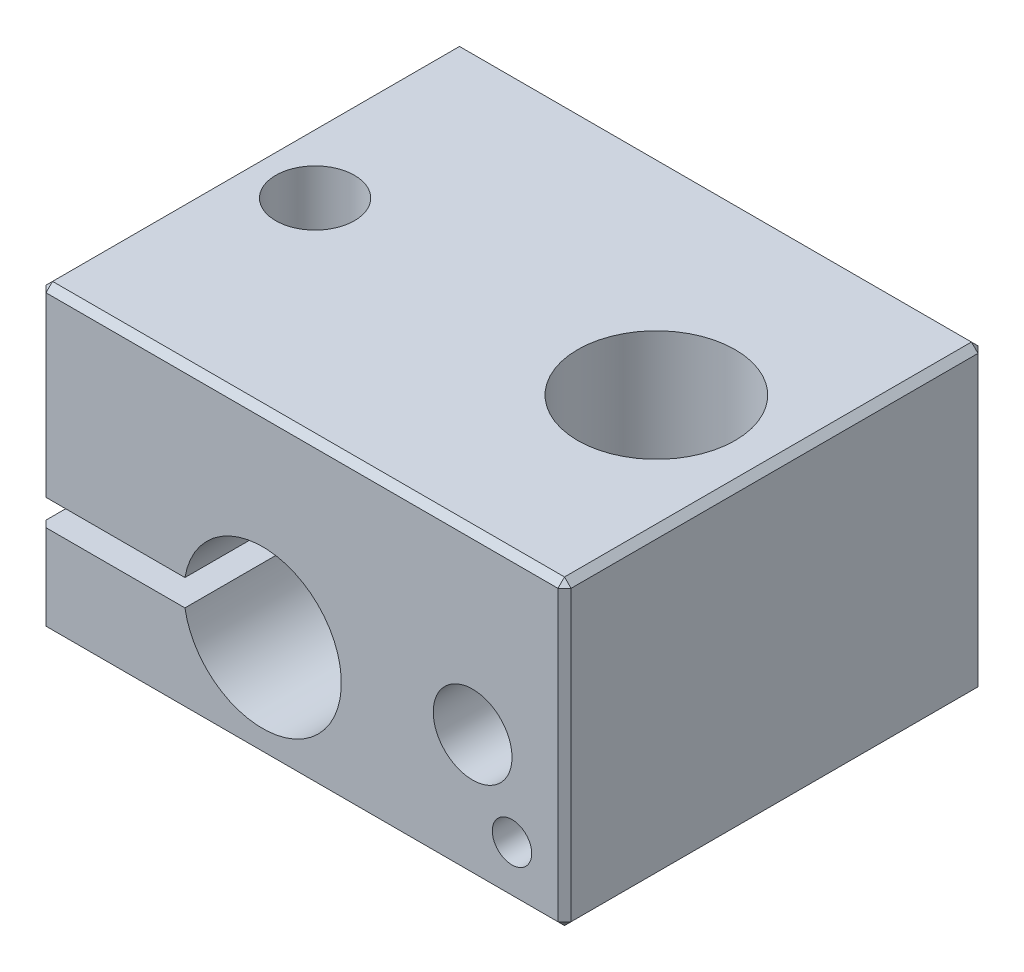
ISO-10303-21;
HEADER;
FILE_DESCRIPTION(('STEP AP214'),'2;1');
FILE_NAME('part.step','',(''),(''),'','','');
FILE_SCHEMA(('AUTOMOTIVE_DESIGN { 1 0 10303 214 1 1 1 1 }'));
ENDSEC;
DATA;
#1=APPLICATION_CONTEXT('core data for automotive mechanical design processes');
#2=APPLICATION_PROTOCOL_DEFINITION('international standard','automotive_design',2000,#1);
#3=PRODUCT_CONTEXT('',#1,'mechanical');
#4=PRODUCT('Part','Part','',(#3));
#5=PRODUCT_RELATED_PRODUCT_CATEGORY('part','',(#4));
#6=PRODUCT_DEFINITION_FORMATION('','',#4);
#7=PRODUCT_DEFINITION_CONTEXT('part definition',#1,'design');
#8=PRODUCT_DEFINITION('design','',#6,#7);
#9=PRODUCT_DEFINITION_SHAPE('','',#8);
#10=(LENGTH_UNIT() NAMED_UNIT(*) SI_UNIT(.MILLI.,.METRE.));
#11=(NAMED_UNIT(*) PLANE_ANGLE_UNIT() SI_UNIT($,.RADIAN.));
#12=(NAMED_UNIT(*) SI_UNIT($,.STERADIAN.) SOLID_ANGLE_UNIT());
#13=UNCERTAINTY_MEASURE_WITH_UNIT(LENGTH_MEASURE(1.E-05),#10,'distance_accuracy_value','');
#14=(GEOMETRIC_REPRESENTATION_CONTEXT(3) GLOBAL_UNCERTAINTY_ASSIGNED_CONTEXT((#13)) GLOBAL_UNIT_ASSIGNED_CONTEXT((#10,
#11,#12)) REPRESENTATION_CONTEXT('',''));
#15=CARTESIAN_POINT('',(0.,0.,0.));
#16=DIRECTION('',(0.,0.,1.));
#17=DIRECTION('',(1.,0.,0.));
#18=AXIS2_PLACEMENT_3D('',#15,#16,#17);
#19=CARTESIAN_POINT('',(-9.99999999999999,11.5,7.99999999999999));
#20=DIRECTION('',(-1.,0.,0.));
#21=DIRECTION('',(0.,0.,1.));
#22=AXIS2_PLACEMENT_3D('',#19,#20,#21);
#23=PLANE('',#22);
#24=DIRECTION('',(0.,0.,-1.));
#25=VECTOR('',#24,1.);
#26=CARTESIAN_POINT('',(-10.,3.5,7.99999999999999));
#27=LINE('',#26,#25);
#28=CARTESIAN_POINT('',(-10.,3.5,7.74999999999999));
#29=VERTEX_POINT('',#28);
#30=CARTESIAN_POINT('',(-10.,3.5,-7.75000000000001));
#31=VERTEX_POINT('',#30);
#32=EDGE_CURVE('E190',#29,#31,#27,.T.);
#33=ORIENTED_EDGE('',*,*,#32,.T.);
#34=DIRECTION('',(0.,-1.,0.));
#35=VECTOR('',#34,1.);
#36=CARTESIAN_POINT('',(-10.,11.5,-7.75000000000001));
#37=LINE('',#36,#35);
#38=CARTESIAN_POINT('',(-10.,0.250000000000004,-7.75000000000001));
#39=VERTEX_POINT('',#38);
#40=EDGE_CURVE('E206',#31,#39,#37,.T.);
#41=ORIENTED_EDGE('',*,*,#40,.T.);
#42=DIRECTION('',(0.,0.,1.));
#43=VECTOR('',#42,1.);
#44=CARTESIAN_POINT('',(-9.99999999999999,0.250000000000004,7.99999999999999));
#45=LINE('',#44,#43);
#46=CARTESIAN_POINT('',(-9.99999999999999,0.250000000000004,7.74999999999999));
#47=VERTEX_POINT('',#46);
#48=EDGE_CURVE('E204',#39,#47,#45,.T.);
#49=ORIENTED_EDGE('',*,*,#48,.T.);
#50=DIRECTION('',(0.,1.,0.));
#51=VECTOR('',#50,1.);
#52=CARTESIAN_POINT('',(-9.99999999999999,11.5,7.74999999999999));
#53=LINE('',#52,#51);
#54=EDGE_CURVE('E171',#47,#29,#53,.T.);
#55=ORIENTED_EDGE('',*,*,#54,.T.);
#56=EDGE_LOOP('',(#33,#41,#49,#55));
#57=FACE_BOUND('',#56,.T.);
#58=ADVANCED_FACE('F32',(#57),#23,.T.);
#59=CARTESIAN_POINT('',(-10.,11.5,-8.00000000000001));
#60=DIRECTION('',(0.,0.,-1.));
#61=DIRECTION('',(-1.,0.,0.));
#62=AXIS2_PLACEMENT_3D('',#59,#60,#61);
#63=PLANE('',#62);
#64=DIRECTION('',(-1.,0.,0.));
#65=VECTOR('',#64,1.);
#66=CARTESIAN_POINT('',(-10.,0.250000000000004,-8.00000000000001));
#67=LINE('',#66,#65);
#68=CARTESIAN_POINT('',(9.75,0.250000000000004,-8.00000000000001));
#69=VERTEX_POINT('',#68);
#70=CARTESIAN_POINT('',(-9.74999999999999,0.250000000000004,-8.00000000000001));
#71=VERTEX_POINT('',#70);
#72=EDGE_CURVE('E215',#69,#71,#67,.T.);
#73=ORIENTED_EDGE('',*,*,#72,.T.);
#74=DIRECTION('',(0.,1.,0.));
#75=VECTOR('',#74,1.);
#76=CARTESIAN_POINT('',(-9.74999999999999,11.5,-8.00000000000001));
#77=LINE('',#76,#75);
#78=CARTESIAN_POINT('',(-9.74999999999999,3.5,-8.00000000000001));
#79=VERTEX_POINT('',#78);
#80=EDGE_CURVE('E217',#71,#79,#77,.T.);
#81=ORIENTED_EDGE('',*,*,#80,.T.);
#82=DIRECTION('',(-1.,0.,0.));
#83=VECTOR('',#82,1.);
#84=CARTESIAN_POINT('',(-4.4580398915498,3.5,-8.00000000000001));
#85=LINE('',#84,#83);
#86=CARTESIAN_POINT('',(-4.4580398915498,3.5,-8.00000000000001));
#87=VERTEX_POINT('',#86);
#88=EDGE_CURVE('E192',#87,#79,#85,.T.);
#89=ORIENTED_EDGE('',*,*,#88,.F.);
#90=CARTESIAN_POINT('',(-1.49999999999999,4.,-8.00000000000001));
#91=DIRECTION('',(0.,0.,1.));
#92=DIRECTION('',(1.,0.,0.));
#93=AXIS2_PLACEMENT_3D('',#90,#91,#92);
#94=CIRCLE('',#93,3.);
#95=CARTESIAN_POINT('',(-4.4580398915498,4.5,-8.00000000000001));
#96=VERTEX_POINT('',#95);
#97=EDGE_CURVE('E166',#87,#96,#94,.T.);
#98=ORIENTED_EDGE('',*,*,#97,.T.);
#99=DIRECTION('',(1.,0.,0.));
#100=VECTOR('',#99,1.);
#101=CARTESIAN_POINT('',(-10.,4.5,-8.00000000000001));
#102=LINE('',#101,#100);
#103=CARTESIAN_POINT('',(-9.74999999999999,4.5,-8.00000000000001));
#104=VERTEX_POINT('',#103);
#105=EDGE_CURVE('E188',#104,#96,#102,.T.);
#106=ORIENTED_EDGE('',*,*,#105,.F.);
#107=DIRECTION('',(0.,1.,0.));
#108=VECTOR('',#107,1.);
#109=CARTESIAN_POINT('',(-9.74999999999999,11.5,-8.00000000000001));
#110=LINE('',#109,#108);
#111=CARTESIAN_POINT('',(-9.74999999999999,11.25,-8.00000000000001));
#112=VERTEX_POINT('',#111);
#113=EDGE_CURVE('E213',#104,#112,#110,.T.);
#114=ORIENTED_EDGE('',*,*,#113,.T.);
#115=DIRECTION('',(1.,0.,0.));
#116=VECTOR('',#115,1.);
#117=CARTESIAN_POINT('',(10.,11.25,-8.00000000000001));
#118=LINE('',#117,#116);
#119=CARTESIAN_POINT('',(9.75,11.25,-8.00000000000001));
#120=VERTEX_POINT('',#119);
#121=EDGE_CURVE('E209',#112,#120,#118,.T.);
#122=ORIENTED_EDGE('',*,*,#121,.T.);
#123=DIRECTION('',(0.,-1.,0.));
#124=VECTOR('',#123,1.);
#125=CARTESIAN_POINT('',(9.75,11.5,-8.00000000000001));
#126=LINE('',#125,#124);
#127=EDGE_CURVE('E211',#120,#69,#126,.T.);
#128=ORIENTED_EDGE('',*,*,#127,.T.);
#129=EDGE_LOOP('',(#73,#81,#89,#98,#106,#114,#122,#128));
#130=FACE_BOUND('',#129,.T.);
#131=ADVANCED_FACE('F392',(#130),#63,.T.);
#132=DIRECTION('',(0.,0.,-1.));
#133=VECTOR('',#132,1.);
#134=CARTESIAN_POINT('',(-10.,11.25,-8.00000000000001));
#135=LINE('',#134,#133);
#136=CARTESIAN_POINT('',(-9.99999999999999,11.25,7.74999999999999));
#137=VERTEX_POINT('',#136);
#138=CARTESIAN_POINT('',(-10.,11.25,-7.75000000000001));
#139=VERTEX_POINT('',#138);
#140=EDGE_CURVE('E252',#137,#139,#135,.T.);
#141=ORIENTED_EDGE('',*,*,#140,.T.);
#142=DIRECTION('',(0.,-1.,0.));
#143=VECTOR('',#142,1.);
#144=CARTESIAN_POINT('',(-10.,11.5,-7.75000000000001));
#145=LINE('',#144,#143);
#146=CARTESIAN_POINT('',(-10.,4.5,-7.75000000000001));
#147=VERTEX_POINT('',#146);
#148=EDGE_CURVE('E254',#139,#147,#145,.T.);
#149=ORIENTED_EDGE('',*,*,#148,.T.);
#150=DIRECTION('',(0.,0.,-1.));
#151=VECTOR('',#150,1.);
#152=CARTESIAN_POINT('',(-10.,4.5,7.99999999999999));
#153=LINE('',#152,#151);
#154=CARTESIAN_POINT('',(-10.,4.5,7.74999999999999));
#155=VERTEX_POINT('',#154);
#156=EDGE_CURVE('E198',#155,#147,#153,.T.);
#157=ORIENTED_EDGE('',*,*,#156,.F.);
#158=DIRECTION('',(0.,1.,0.));
#159=VECTOR('',#158,1.);
#160=CARTESIAN_POINT('',(-9.99999999999999,11.5,7.74999999999999));
#161=LINE('',#160,#159);
#162=EDGE_CURVE('E250',#155,#137,#161,.T.);
#163=ORIENTED_EDGE('',*,*,#162,.T.);
#164=EDGE_LOOP('',(#141,#149,#157,#163));
#165=FACE_BOUND('',#164,.T.);
#166=ADVANCED_FACE('F397',(#165),#23,.T.);
#167=CARTESIAN_POINT('',(10.,11.5,7.99999999999999));
#168=DIRECTION('',(0.,0.,1.));
#169=DIRECTION('',(1.,0.,0.));
#170=AXIS2_PLACEMENT_3D('',#167,#168,#169);
#171=PLANE('',#170);
#172=DIRECTION('',(-1.,0.,0.));
#173=VECTOR('',#172,1.);
#174=CARTESIAN_POINT('',(-4.4580398915498,3.5,7.99999999999999));
#175=LINE('',#174,#173);
#176=CARTESIAN_POINT('',(-4.4580398915498,3.5,7.99999999999999));
#177=VERTEX_POINT('',#176);
#178=CARTESIAN_POINT('',(-9.74999999999999,3.5,7.99999999999999));
#179=VERTEX_POINT('',#178);
#180=EDGE_CURVE('E178',#177,#179,#175,.T.);
#181=ORIENTED_EDGE('',*,*,#180,.T.);
#182=DIRECTION('',(0.,-1.,0.));
#183=VECTOR('',#182,1.);
#184=CARTESIAN_POINT('',(-9.75,11.5,7.99999999999999));
#185=LINE('',#184,#183);
#186=CARTESIAN_POINT('',(-9.75,0.250000000000004,7.99999999999999));
#187=VERTEX_POINT('',#186);
#188=EDGE_CURVE('E239',#179,#187,#185,.T.);
#189=ORIENTED_EDGE('',*,*,#188,.T.);
#190=DIRECTION('',(1.,0.,0.));
#191=VECTOR('',#190,1.);
#192=CARTESIAN_POINT('',(10.,0.250000000000004,7.99999999999999));
#193=LINE('',#192,#191);
#194=CARTESIAN_POINT('',(9.75,0.250000000000004,7.99999999999999));
#195=VERTEX_POINT('',#194);
#196=EDGE_CURVE('E237',#187,#195,#193,.T.);
#197=ORIENTED_EDGE('',*,*,#196,.T.);
#198=DIRECTION('',(0.,1.,0.));
#199=VECTOR('',#198,1.);
#200=CARTESIAN_POINT('',(9.75,11.5,7.99999999999999));
#201=LINE('',#200,#199);
#202=CARTESIAN_POINT('',(9.75,11.25,7.99999999999999));
#203=VERTEX_POINT('',#202);
#204=EDGE_CURVE('E233',#195,#203,#201,.T.);
#205=ORIENTED_EDGE('',*,*,#204,.T.);
#206=DIRECTION('',(-1.,0.,0.));
#207=VECTOR('',#206,1.);
#208=CARTESIAN_POINT('',(-9.99999999999999,11.25,7.99999999999999));
#209=LINE('',#208,#207);
#210=CARTESIAN_POINT('',(-9.75,11.25,7.99999999999999));
#211=VERTEX_POINT('',#210);
#212=EDGE_CURVE('E231',#203,#211,#209,.T.);
#213=ORIENTED_EDGE('',*,*,#212,.T.);
#214=DIRECTION('',(0.,-1.,0.));
#215=VECTOR('',#214,1.);
#216=CARTESIAN_POINT('',(-9.75,11.5,7.99999999999999));
#217=LINE('',#216,#215);
#218=CARTESIAN_POINT('',(-9.75,4.5,7.99999999999999));
#219=VERTEX_POINT('',#218);
#220=EDGE_CURVE('E235',#211,#219,#217,.T.);
#221=ORIENTED_EDGE('',*,*,#220,.T.);
#222=DIRECTION('',(1.,0.,0.));
#223=VECTOR('',#222,1.);
#224=CARTESIAN_POINT('',(-10.,4.5,7.99999999999999));
#225=LINE('',#224,#223);
#226=CARTESIAN_POINT('',(-4.4580398915498,4.5,7.99999999999999));
#227=VERTEX_POINT('',#226);
#228=EDGE_CURVE('E181',#219,#227,#225,.T.);
#229=ORIENTED_EDGE('',*,*,#228,.T.);
#230=CARTESIAN_POINT('',(-1.49999999999999,4.,7.99999999999999));
#231=DIRECTION('',(0.,0.,1.));
#232=DIRECTION('',(1.,0.,0.));
#233=AXIS2_PLACEMENT_3D('',#230,#231,#232);
#234=CIRCLE('',#233,3.);
#235=EDGE_CURVE('E163',#177,#227,#234,.T.);
#236=ORIENTED_EDGE('',*,*,#235,.F.);
#237=EDGE_LOOP('',(#181,#189,#197,#205,#213,#221,#229,#236));
#238=FACE_BOUND('',#237,.T.);
#239=CARTESIAN_POINT('',(8.00000000000001,2.,7.99999999999999));
#240=DIRECTION('',(0.,0.,1.));
#241=DIRECTION('',(1.,0.,0.));
#242=AXIS2_PLACEMENT_3D('',#239,#240,#241);
#243=CIRCLE('',#242,0.74999999999999);
#244=CARTESIAN_POINT('',(8.75,2.,7.99999999999999));
#245=VERTEX_POINT('',#244);
#246=EDGE_CURVE('E329',#245,#245,#243,.T.);
#247=ORIENTED_EDGE('',*,*,#246,.F.);
#248=EDGE_LOOP('',(#247));
#249=FACE_BOUND('',#248,.T.);
#250=CARTESIAN_POINT('',(6.50000000000001,4.8,7.99999999999999));
#251=DIRECTION('',(0.,0.,1.));
#252=DIRECTION('',(1.,0.,0.));
#253=AXIS2_PLACEMENT_3D('',#250,#251,#252);
#254=CIRCLE('',#253,1.49999999999999);
#255=CARTESIAN_POINT('',(8.,4.8,7.99999999999999));
#256=VERTEX_POINT('',#255);
#257=EDGE_CURVE('E339',#256,#256,#254,.T.);
#258=ORIENTED_EDGE('',*,*,#257,.F.);
#259=EDGE_LOOP('',(#258));
#260=FACE_BOUND('',#259,.T.);
#261=ADVANCED_FACE('F176',(#238,#249,#260),#171,.T.);
#262=CARTESIAN_POINT('',(10.,11.5,-8.00000000000001));
#263=DIRECTION('',(1.,0.,0.));
#264=DIRECTION('',(0.,0.,-1.));
#265=AXIS2_PLACEMENT_3D('',#262,#263,#264);
#266=PLANE('',#265);
#267=DIRECTION('',(0.,-1.,0.));
#268=VECTOR('',#267,1.);
#269=CARTESIAN_POINT('',(10.,11.5,7.75));
#270=LINE('',#269,#268);
#271=CARTESIAN_POINT('',(10.,11.25,7.75));
#272=VERTEX_POINT('',#271);
#273=CARTESIAN_POINT('',(10.,0.249999999999997,7.75));
#274=VERTEX_POINT('',#273);
#275=EDGE_CURVE('E243',#272,#274,#270,.T.);
#276=ORIENTED_EDGE('',*,*,#275,.T.);
#277=DIRECTION('',(0.,0.,-1.));
#278=VECTOR('',#277,1.);
#279=CARTESIAN_POINT('',(10.,0.249999999999997,-8.00000000000001));
#280=LINE('',#279,#278);
#281=CARTESIAN_POINT('',(10.,0.249999999999997,-7.75000000000001));
#282=VERTEX_POINT('',#281);
#283=EDGE_CURVE('E247',#274,#282,#280,.T.);
#284=ORIENTED_EDGE('',*,*,#283,.T.);
#285=DIRECTION('',(0.,1.,0.));
#286=VECTOR('',#285,1.);
#287=CARTESIAN_POINT('',(10.,11.5,-7.75000000000001));
#288=LINE('',#287,#286);
#289=CARTESIAN_POINT('',(10.,11.25,-7.75000000000001));
#290=VERTEX_POINT('',#289);
#291=EDGE_CURVE('E245',#282,#290,#288,.T.);
#292=ORIENTED_EDGE('',*,*,#291,.T.);
#293=DIRECTION('',(0.,0.,1.));
#294=VECTOR('',#293,1.);
#295=CARTESIAN_POINT('',(10.,11.25,7.99999999999999));
#296=LINE('',#295,#294);
#297=EDGE_CURVE('E241',#290,#272,#296,.T.);
#298=ORIENTED_EDGE('',*,*,#297,.T.);
#299=EDGE_LOOP('',(#276,#284,#292,#298));
#300=FACE_BOUND('',#299,.T.);
#301=ADVANCED_FACE('F466',(#300),#266,.T.);
#302=CARTESIAN_POINT('',(0.,11.5,0.));
#303=DIRECTION('',(0.,-1.,0.));
#304=DIRECTION('',(0.,0.,-1.));
#305=AXIS2_PLACEMENT_3D('',#302,#303,#304);
#306=PLANE('',#305);
#307=DIRECTION('',(-1.,0.,0.));
#308=VECTOR('',#307,1.);
#309=CARTESIAN_POINT('',(-10.,11.5,-7.75));
#310=LINE('',#309,#308);
#311=CARTESIAN_POINT('',(9.75,11.5,-7.75));
#312=VERTEX_POINT('',#311);
#313=CARTESIAN_POINT('',(-9.74999999999999,11.5,-7.75));
#314=VERTEX_POINT('',#313);
#315=EDGE_CURVE('E41',#312,#314,#310,.T.);
#316=ORIENTED_EDGE('',*,*,#315,.T.);
#317=DIRECTION('',(0.,0.,1.));
#318=VECTOR('',#317,1.);
#319=CARTESIAN_POINT('',(-9.74999999999999,11.5,7.99999999999999));
#320=LINE('',#319,#318);
#321=CARTESIAN_POINT('',(-9.74999999999999,11.5,7.74999999999999));
#322=VERTEX_POINT('',#321);
#323=EDGE_CURVE('E11',#314,#322,#320,.T.);
#324=ORIENTED_EDGE('',*,*,#323,.T.);
#325=DIRECTION('',(1.,0.,0.));
#326=VECTOR('',#325,1.);
#327=CARTESIAN_POINT('',(10.,11.5,7.74999999999999));
#328=LINE('',#327,#326);
#329=CARTESIAN_POINT('',(9.75,11.5,7.74999999999999));
#330=VERTEX_POINT('',#329);
#331=EDGE_CURVE('E55',#322,#330,#328,.T.);
#332=ORIENTED_EDGE('',*,*,#331,.T.);
#333=DIRECTION('',(0.,0.,-1.));
#334=VECTOR('',#333,1.);
#335=CARTESIAN_POINT('',(9.75,11.5,-8.00000000000001));
#336=LINE('',#335,#334);
#337=EDGE_CURVE('E260',#330,#312,#336,.T.);
#338=ORIENTED_EDGE('',*,*,#337,.T.);
#339=EDGE_LOOP('',(#316,#324,#332,#338));
#340=FACE_BOUND('',#339,.T.);
#341=CARTESIAN_POINT('',(5.50000000000001,11.5,0.));
#342=DIRECTION('',(0.,-1.,0.));
#343=DIRECTION('',(0.,0.,-1.));
#344=AXIS2_PLACEMENT_3D('',#341,#342,#343);
#345=CIRCLE('',#344,2.99999999999999);
#346=CARTESIAN_POINT('',(5.50000000000001,11.5,-2.99999999999999));
#347=VERTEX_POINT('',#346);
#348=EDGE_CURVE('E356',#347,#347,#345,.T.);
#349=ORIENTED_EDGE('',*,*,#348,.T.);
#350=EDGE_LOOP('',(#349));
#351=FACE_BOUND('',#350,.T.);
#352=CARTESIAN_POINT('',(-7.49999999999999,11.5,0.));
#353=DIRECTION('',(0.,-1.,0.));
#354=DIRECTION('',(0.,0.,-1.));
#355=AXIS2_PLACEMENT_3D('',#352,#353,#354);
#356=CIRCLE('',#355,1.49999999999999);
#357=CARTESIAN_POINT('',(-7.49999999999999,11.5,-1.49999999999999));
#358=VERTEX_POINT('',#357);
#359=EDGE_CURVE('E182',#358,#358,#356,.T.);
#360=ORIENTED_EDGE('',*,*,#359,.T.);
#361=EDGE_LOOP('',(#360));
#362=FACE_BOUND('',#361,.T.);
#363=ADVANCED_FACE('F365',(#340,#351,#362),#306,.F.);
#364=CARTESIAN_POINT('',(0.,0.,0.));
#365=DIRECTION('',(0.,-1.,0.));
#366=DIRECTION('',(0.,0.,-1.));
#367=AXIS2_PLACEMENT_3D('',#364,#365,#366);
#368=PLANE('',#367);
#369=DIRECTION('',(-1.,0.,0.));
#370=VECTOR('',#369,1.);
#371=CARTESIAN_POINT('',(0.,0.,7.75));
#372=LINE('',#371,#370);
#373=CARTESIAN_POINT('',(9.75,0.,7.75));
#374=VERTEX_POINT('',#373);
#375=CARTESIAN_POINT('',(-9.75,0.,7.75));
#376=VERTEX_POINT('',#375);
#377=EDGE_CURVE('E224',#374,#376,#372,.T.);
#378=ORIENTED_EDGE('',*,*,#377,.T.);
#379=DIRECTION('',(0.,0.,-1.));
#380=VECTOR('',#379,1.);
#381=CARTESIAN_POINT('',(-9.75,0.,0.));
#382=LINE('',#381,#380);
#383=CARTESIAN_POINT('',(-9.75,0.,-7.75000000000001));
#384=VERTEX_POINT('',#383);
#385=EDGE_CURVE('E228',#376,#384,#382,.T.);
#386=ORIENTED_EDGE('',*,*,#385,.T.);
#387=DIRECTION('',(1.,0.,0.));
#388=VECTOR('',#387,1.);
#389=CARTESIAN_POINT('',(0.,0.,-7.75000000000001));
#390=LINE('',#389,#388);
#391=CARTESIAN_POINT('',(9.75,0.,-7.75000000000001));
#392=VERTEX_POINT('',#391);
#393=EDGE_CURVE('E226',#384,#392,#390,.T.);
#394=ORIENTED_EDGE('',*,*,#393,.T.);
#395=DIRECTION('',(0.,0.,1.));
#396=VECTOR('',#395,1.);
#397=CARTESIAN_POINT('',(9.75,0.,0.));
#398=LINE('',#397,#396);
#399=EDGE_CURVE('E222',#392,#374,#398,.T.);
#400=ORIENTED_EDGE('',*,*,#399,.T.);
#401=EDGE_LOOP('',(#378,#386,#394,#400));
#402=FACE_BOUND('',#401,.T.);
#403=CARTESIAN_POINT('',(-7.49999999999999,0.,0.));
#404=DIRECTION('',(0.,1.,0.));
#405=DIRECTION('',(0.,0.,1.));
#406=AXIS2_PLACEMENT_3D('',#403,#404,#405);
#407=CIRCLE('',#406,1.49999999999999);
#408=CARTESIAN_POINT('',(-7.49999999999999,0.,1.49999999999998));
#409=VERTEX_POINT('',#408);
#410=EDGE_CURVE('E350',#409,#409,#407,.T.);
#411=ORIENTED_EDGE('',*,*,#410,.T.);
#412=EDGE_LOOP('',(#411));
#413=FACE_BOUND('',#412,.T.);
#414=CARTESIAN_POINT('',(5.50000000000001,0.,0.));
#415=DIRECTION('',(0.,-1.,0.));
#416=DIRECTION('',(0.,0.,-1.));
#417=AXIS2_PLACEMENT_3D('',#414,#415,#416);
#418=CIRCLE('',#417,2.99999999999999);
#419=CARTESIAN_POINT('',(5.50000000000001,0.,-3.));
#420=VERTEX_POINT('',#419);
#421=EDGE_CURVE('E353',#420,#420,#418,.T.);
#422=ORIENTED_EDGE('',*,*,#421,.F.);
#423=EDGE_LOOP('',(#422));
#424=FACE_BOUND('',#423,.T.);
#425=ADVANCED_FACE('F465',(#402,#413,#424),#368,.T.);
#426=CARTESIAN_POINT('',(-4.4580398915498,3.5,7.99999999999999));
#427=DIRECTION('',(0.,-1.,0.));
#428=DIRECTION('',(1.,0.,0.));
#429=AXIS2_PLACEMENT_3D('',#426,#427,#428);
#430=PLANE('',#429);
#431=CARTESIAN_POINT('',(-7.49999999999999,3.5,0.));
#432=DIRECTION('',(0.,1.,0.));
#433=DIRECTION('',(0.,0.,1.));
#434=AXIS2_PLACEMENT_3D('',#431,#432,#433);
#435=CIRCLE('',#434,1.49999999999999);
#436=CARTESIAN_POINT('',(-7.49999999999999,3.5,1.49999999999998));
#437=VERTEX_POINT('',#436);
#438=EDGE_CURVE('E347',#437,#437,#435,.T.);
#439=ORIENTED_EDGE('',*,*,#438,.F.);
#440=EDGE_LOOP('',(#439));
#441=FACE_BOUND('',#440,.T.);
#442=ORIENTED_EDGE('',*,*,#88,.T.);
#443=DIRECTION('',(0.707106781186557,0.,-0.707106781186538));
#444=VECTOR('',#443,1.);
#445=CARTESIAN_POINT('',(-10.,3.5,-7.75000000000001));
#446=LINE('',#445,#444);
#447=EDGE_CURVE('E220',#79,#31,#446,.F.);
#448=ORIENTED_EDGE('',*,*,#447,.T.);
#449=ORIENTED_EDGE('',*,*,#32,.F.);
#450=DIRECTION('',(-0.70710678118654,0.,-0.707106781186555));
#451=VECTOR('',#450,1.);
#452=CARTESIAN_POINT('',(-9.75,3.5,7.99999999999999));
#453=LINE('',#452,#451);
#454=EDGE_CURVE('E187',#29,#179,#453,.F.);
#455=ORIENTED_EDGE('',*,*,#454,.T.);
#456=ORIENTED_EDGE('',*,*,#180,.F.);
#457=DIRECTION('',(0.,0.,-1.));
#458=VECTOR('',#457,1.);
#459=CARTESIAN_POINT('',(-4.4580398915498,3.5,7.99999999999999));
#460=LINE('',#459,#458);
#461=EDGE_CURVE('E159',#177,#87,#460,.T.);
#462=ORIENTED_EDGE('',*,*,#461,.T.);
#463=EDGE_LOOP('',(#442,#448,#449,#455,#456,#462));
#464=FACE_BOUND('',#463,.T.);
#465=ADVANCED_FACE('F184',(#441,#464),#430,.F.);
#466=CARTESIAN_POINT('',(-10.,4.5,7.99999999999999));
#467=DIRECTION('',(0.,1.,0.));
#468=DIRECTION('',(0.,0.,1.));
#469=AXIS2_PLACEMENT_3D('',#466,#467,#468);
#470=PLANE('',#469);
#471=CARTESIAN_POINT('',(-7.49999999999999,4.5,0.));
#472=DIRECTION('',(0.,-1.,0.));
#473=DIRECTION('',(0.,0.,-1.));
#474=AXIS2_PLACEMENT_3D('',#471,#472,#473);
#475=CIRCLE('',#474,1.49999999999999);
#476=CARTESIAN_POINT('',(-7.49999999999999,4.5,-1.49999999999999));
#477=VERTEX_POINT('',#476);
#478=EDGE_CURVE('E359',#477,#477,#475,.T.);
#479=ORIENTED_EDGE('',*,*,#478,.F.);
#480=EDGE_LOOP('',(#479));
#481=FACE_BOUND('',#480,.T.);
#482=ORIENTED_EDGE('',*,*,#156,.T.);
#483=DIRECTION('',(-0.707106781186557,0.,0.707106781186538));
#484=VECTOR('',#483,1.);
#485=CARTESIAN_POINT('',(-10.,4.5,-7.75000000000001));
#486=LINE('',#485,#484);
#487=EDGE_CURVE('E258',#147,#104,#486,.F.);
#488=ORIENTED_EDGE('',*,*,#487,.T.);
#489=ORIENTED_EDGE('',*,*,#105,.T.);
#490=DIRECTION('',(0.,0.,-1.));
#491=VECTOR('',#490,1.);
#492=CARTESIAN_POINT('',(-4.4580398915498,4.5,7.99999999999999));
#493=LINE('',#492,#491);
#494=EDGE_CURVE('E172',#227,#96,#493,.T.);
#495=ORIENTED_EDGE('',*,*,#494,.F.);
#496=ORIENTED_EDGE('',*,*,#228,.F.);
#497=DIRECTION('',(0.70710678118654,0.,0.707106781186555));
#498=VECTOR('',#497,1.);
#499=CARTESIAN_POINT('',(-9.75,4.5,7.99999999999999));
#500=LINE('',#499,#498);
#501=EDGE_CURVE('E256',#219,#155,#500,.F.);
#502=ORIENTED_EDGE('',*,*,#501,.T.);
#503=EDGE_LOOP('',(#482,#488,#489,#495,#496,#502));
#504=FACE_BOUND('',#503,.T.);
#505=ADVANCED_FACE('F374',(#481,#504),#470,.F.);
#506=CARTESIAN_POINT('',(-1.49999999999999,4.,-8.00000000000001));
#507=DIRECTION('',(0.,0.,1.));
#508=DIRECTION('',(1.,0.,0.));
#509=AXIS2_PLACEMENT_3D('',#506,#507,#508);
#510=CYLINDRICAL_SURFACE('',#509,3.);
#511=ORIENTED_EDGE('',*,*,#235,.T.);
#512=ORIENTED_EDGE('',*,*,#494,.T.);
#513=ORIENTED_EDGE('',*,*,#97,.F.);
#514=ORIENTED_EDGE('',*,*,#461,.F.);
#515=EDGE_LOOP('',(#511,#512,#513,#514));
#516=FACE_BOUND('',#515,.T.);
#517=ADVANCED_FACE('F161',(#516),#510,.F.);
#518=CARTESIAN_POINT('',(-7.49999999999999,4.5,0.));
#519=DIRECTION('',(0.,-1.,0.));
#520=DIRECTION('',(0.,0.,-1.));
#521=AXIS2_PLACEMENT_3D('',#518,#519,#520);
#522=CYLINDRICAL_SURFACE('',#521,1.49999999999999);
#523=ORIENTED_EDGE('',*,*,#359,.F.);
#524=EDGE_LOOP('',(#523));
#525=FACE_BOUND('',#524,.T.);
#526=ORIENTED_EDGE('',*,*,#478,.T.);
#527=EDGE_LOOP('',(#526));
#528=FACE_BOUND('',#527,.T.);
#529=ADVANCED_FACE('F367',(#525,#528),#522,.F.);
#530=CARTESIAN_POINT('',(5.50000000000001,0.,0.));
#531=DIRECTION('',(0.,-1.,0.));
#532=DIRECTION('',(0.,0.,-1.));
#533=AXIS2_PLACEMENT_3D('',#530,#531,#532);
#534=CYLINDRICAL_SURFACE('',#533,2.99999999999999);
#535=ORIENTED_EDGE('',*,*,#348,.F.);
#536=EDGE_LOOP('',(#535));
#537=FACE_BOUND('',#536,.T.);
#538=ORIENTED_EDGE('',*,*,#421,.T.);
#539=EDGE_LOOP('',(#538));
#540=FACE_BOUND('',#539,.T.);
#541=ADVANCED_FACE('F370',(#537,#540),#534,.F.);
#542=CARTESIAN_POINT('',(-7.49999999999999,3.5,0.));
#543=DIRECTION('',(0.,1.,0.));
#544=DIRECTION('',(0.,0.,1.));
#545=AXIS2_PLACEMENT_3D('',#542,#543,#544);
#546=CYLINDRICAL_SURFACE('',#545,1.49999999999999);
#547=ORIENTED_EDGE('',*,*,#410,.F.);
#548=EDGE_LOOP('',(#547));
#549=FACE_BOUND('',#548,.T.);
#550=ORIENTED_EDGE('',*,*,#438,.T.);
#551=EDGE_LOOP('',(#550));
#552=FACE_BOUND('',#551,.T.);
#553=ADVANCED_FACE('F472',(#549,#552),#546,.F.);
#554=CARTESIAN_POINT('',(6.50000000000001,4.8,4.49999999999999));
#555=DIRECTION('',(0.,0.,-1.));
#556=DIRECTION('',(-1.,0.,0.));
#557=AXIS2_PLACEMENT_3D('',#554,#555,#556);
#558=PLANE('',#557);
#559=CARTESIAN_POINT('',(6.50000000000001,4.8,4.49999999999999));
#560=DIRECTION('',(0.,0.,1.));
#561=DIRECTION('',(1.,0.,0.));
#562=AXIS2_PLACEMENT_3D('',#559,#560,#561);
#563=CIRCLE('',#562,1.49999999999999);
#564=CARTESIAN_POINT('',(7.99999999999999,4.8,4.49999999999999));
#565=VERTEX_POINT('',#564);
#566=EDGE_CURVE('E344',#565,#565,#563,.T.);
#567=ORIENTED_EDGE('',*,*,#566,.T.);
#568=EDGE_LOOP('',(#567));
#569=FACE_BOUND('',#568,.T.);
#570=ADVANCED_FACE('F569',(#569),#558,.F.);
#571=CARTESIAN_POINT('',(6.50000000000001,4.8,7.99999999999999));
#572=DIRECTION('',(0.,0.,1.));
#573=DIRECTION('',(1.,0.,0.));
#574=AXIS2_PLACEMENT_3D('',#571,#572,#573);
#575=CYLINDRICAL_SURFACE('',#574,1.49999999999999);
#576=ORIENTED_EDGE('',*,*,#566,.F.);
#577=EDGE_LOOP('',(#576));
#578=FACE_BOUND('',#577,.T.);
#579=ORIENTED_EDGE('',*,*,#257,.T.);
#580=EDGE_LOOP('',(#579));
#581=FACE_BOUND('',#580,.T.);
#582=ADVANCED_FACE('F562',(#578,#581),#575,.F.);
#583=CARTESIAN_POINT('',(8.00000000000001,2.,3.49999999999999));
#584=DIRECTION('',(0.,0.,-1.));
#585=DIRECTION('',(-1.,0.,0.));
#586=AXIS2_PLACEMENT_3D('',#583,#584,#585);
#587=PLANE('',#586);
#588=CARTESIAN_POINT('',(8.00000000000001,2.,3.49999999999999));
#589=DIRECTION('',(0.,0.,1.));
#590=DIRECTION('',(1.,0.,0.));
#591=AXIS2_PLACEMENT_3D('',#588,#589,#590);
#592=CIRCLE('',#591,0.749999999999989);
#593=CARTESIAN_POINT('',(8.75,2.,3.49999999999999));
#594=VERTEX_POINT('',#593);
#595=EDGE_CURVE('E334',#594,#594,#592,.T.);
#596=ORIENTED_EDGE('',*,*,#595,.T.);
#597=EDGE_LOOP('',(#596));
#598=FACE_BOUND('',#597,.T.);
#599=ADVANCED_FACE('F556',(#598),#587,.F.);
#600=CARTESIAN_POINT('',(8.00000000000001,2.,7.99999999999999));
#601=DIRECTION('',(0.,0.,1.));
#602=DIRECTION('',(1.,0.,0.));
#603=AXIS2_PLACEMENT_3D('',#600,#601,#602);
#604=CYLINDRICAL_SURFACE('',#603,0.749999999999989);
#605=ORIENTED_EDGE('',*,*,#595,.F.);
#606=EDGE_LOOP('',(#605));
#607=FACE_BOUND('',#606,.T.);
#608=ORIENTED_EDGE('',*,*,#246,.T.);
#609=EDGE_LOOP('',(#608));
#610=FACE_BOUND('',#609,.T.);
#611=ADVANCED_FACE('F552',(#607,#610),#604,.F.);
#612=CARTESIAN_POINT('',(-9.75,11.5,7.99999999999999));
#613=DIRECTION('',(0.707106781186555,0.,-0.70710678118654));
#614=DIRECTION('',(0.,-1.,0.));
#615=AXIS2_PLACEMENT_3D('',#612,#613,#614);
#616=PLANE('',#615);
#617=DIRECTION('',(-0.70710678118654,0.,-0.707106781186555));
#618=VECTOR('',#617,1.);
#619=CARTESIAN_POINT('',(-9.87499999999999,11.25,7.87499999999999));
#620=LINE('',#619,#618);
#621=EDGE_CURVE('E36',#137,#211,#620,.F.);
#622=ORIENTED_EDGE('',*,*,#621,.F.);
#623=ORIENTED_EDGE('',*,*,#162,.F.);
#624=ORIENTED_EDGE('',*,*,#501,.F.);
#625=ORIENTED_EDGE('',*,*,#220,.F.);
#626=EDGE_LOOP('',(#622,#623,#624,#625));
#627=FACE_BOUND('',#626,.T.);
#628=ADVANCED_FACE('F34',(#627),#616,.F.);
#629=CARTESIAN_POINT('',(-9.74999999999999,11.5,7.74999999999999));
#630=DIRECTION('',(-0.577350269189623,0.577350269189643,0.577350269189611));
#631=DIRECTION('',(-0.70710678118656,-0.707106781186535,0.));
#632=AXIS2_PLACEMENT_3D('',#629,#630,#631);
#633=PLANE('',#632);
#634=DIRECTION('',(-0.707106781186559,-0.707106781186536,0.));
#635=VECTOR('',#634,1.);
#636=CARTESIAN_POINT('',(-9.74999999999999,11.5,7.74999999999999));
#637=LINE('',#636,#635);
#638=EDGE_CURVE('E324',#137,#322,#637,.F.);
#639=ORIENTED_EDGE('',*,*,#638,.F.);
#640=ORIENTED_EDGE('',*,*,#621,.T.);
#641=DIRECTION('',(0.,0.707106781186538,-0.707106781186557));
#642=VECTOR('',#641,1.);
#643=CARTESIAN_POINT('',(-9.74999999999999,11.5,7.74999999999999));
#644=LINE('',#643,#642);
#645=EDGE_CURVE('E326',#322,#211,#644,.F.);
#646=ORIENTED_EDGE('',*,*,#645,.F.);
#647=EDGE_LOOP('',(#639,#640,#646));
#648=FACE_BOUND('',#647,.T.);
#649=ADVANCED_FACE('F547',(#648),#633,.T.);
#650=CARTESIAN_POINT('',(10.,11.25,7.99999999999999));
#651=DIRECTION('',(0.,0.707106781186557,0.707106781186538));
#652=DIRECTION('',(1.,0.,0.));
#653=AXIS2_PLACEMENT_3D('',#650,#651,#652);
#654=PLANE('',#653);
#655=ORIENTED_EDGE('',*,*,#645,.T.);
#656=ORIENTED_EDGE('',*,*,#212,.F.);
#657=DIRECTION('',(0.,-0.707106781186538,0.707106781186557));
#658=VECTOR('',#657,1.);
#659=CARTESIAN_POINT('',(9.75,11.25,7.99999999999999));
#660=LINE('',#659,#658);
#661=EDGE_CURVE('E321',#330,#203,#660,.T.);
#662=ORIENTED_EDGE('',*,*,#661,.F.);
#663=ORIENTED_EDGE('',*,*,#331,.F.);
#664=EDGE_LOOP('',(#655,#656,#662,#663));
#665=FACE_BOUND('',#664,.T.);
#666=ADVANCED_FACE('F455',(#665),#654,.T.);
#667=CARTESIAN_POINT('',(-9.99999999999999,11.25,7.99999999999999));
#668=DIRECTION('',(-0.707106781186537,0.707106781186559,0.));
#669=DIRECTION('',(0.,0.,1.));
#670=AXIS2_PLACEMENT_3D('',#667,#668,#669);
#671=PLANE('',#670);
#672=ORIENTED_EDGE('',*,*,#638,.T.);
#673=ORIENTED_EDGE('',*,*,#323,.F.);
#674=DIRECTION('',(0.707106781186558,0.707106781186537,0.));
#675=VECTOR('',#674,1.);
#676=CARTESIAN_POINT('',(-9.87499999999999,11.375,-7.75000000000001));
#677=LINE('',#676,#675);
#678=EDGE_CURVE('E318',#139,#314,#677,.T.);
#679=ORIENTED_EDGE('',*,*,#678,.F.);
#680=ORIENTED_EDGE('',*,*,#140,.F.);
#681=EDGE_LOOP('',(#672,#673,#679,#680));
#682=FACE_BOUND('',#681,.T.);
#683=ADVANCED_FACE('F400',(#682),#671,.T.);
#684=CARTESIAN_POINT('',(-10.,11.5,-7.75000000000001));
#685=DIRECTION('',(0.707106781186538,0.,0.707106781186557));
#686=DIRECTION('',(0.,-1.,0.));
#687=AXIS2_PLACEMENT_3D('',#684,#685,#686);
#688=PLANE('',#687);
#689=ORIENTED_EDGE('',*,*,#487,.F.);
#690=ORIENTED_EDGE('',*,*,#148,.F.);
#691=DIRECTION('',(0.707106781186557,0.,-0.707106781186538));
#692=VECTOR('',#691,1.);
#693=CARTESIAN_POINT('',(-9.74999999999999,11.25,-8.00000000000001));
#694=LINE('',#693,#692);
#695=EDGE_CURVE('E315',#112,#139,#694,.F.);
#696=ORIENTED_EDGE('',*,*,#695,.F.);
#697=ORIENTED_EDGE('',*,*,#113,.F.);
#698=EDGE_LOOP('',(#689,#690,#696,#697));
#699=FACE_BOUND('',#698,.T.);
#700=ADVANCED_FACE('F387',(#699),#688,.F.);
#701=CARTESIAN_POINT('',(9.75,11.25,7.99999999999999));
#702=DIRECTION('',(0.57735026918961,0.577350269189642,0.577350269189626));
#703=DIRECTION('',(0.,-0.707106781186538,0.707106781186557));
#704=AXIS2_PLACEMENT_3D('',#701,#702,#703);
#705=PLANE('',#704);
#706=DIRECTION('',(-0.707106781186557,0.707106781186538,0.));
#707=VECTOR('',#706,1.);
#708=CARTESIAN_POINT('',(9.87500000000001,11.375,7.74999999999999));
#709=LINE('',#708,#707);
#710=EDGE_CURVE('E309',#330,#272,#709,.F.);
#711=ORIENTED_EDGE('',*,*,#710,.F.);
#712=ORIENTED_EDGE('',*,*,#661,.T.);
#713=DIRECTION('',(-0.707106781186557,0.,0.707106781186538));
#714=VECTOR('',#713,1.);
#715=CARTESIAN_POINT('',(9.75,11.25,7.99999999999999));
#716=LINE('',#715,#714);
#717=EDGE_CURVE('E312',#272,#203,#716,.T.);
#718=ORIENTED_EDGE('',*,*,#717,.F.);
#719=EDGE_LOOP('',(#711,#712,#718));
#720=FACE_BOUND('',#719,.T.);
#721=ADVANCED_FACE('F458',(#720),#705,.T.);
#722=CARTESIAN_POINT('',(-9.74999999999999,11.25,-8.00000000000001));
#723=DIRECTION('',(-0.577350269189608,0.577350269189644,-0.577350269189624));
#724=DIRECTION('',(0.,0.707106781186535,0.70710678118656));
#725=AXIS2_PLACEMENT_3D('',#722,#723,#724);
#726=PLANE('',#725);
#727=ORIENTED_EDGE('',*,*,#695,.T.);
#728=ORIENTED_EDGE('',*,*,#678,.T.);
#729=DIRECTION('',(0.,-0.707106781186538,-0.707106781186557));
#730=VECTOR('',#729,1.);
#731=CARTESIAN_POINT('',(-9.74999999999999,11.25,-8.00000000000001));
#732=LINE('',#731,#730);
#733=EDGE_CURVE('E306',#112,#314,#732,.F.);
#734=ORIENTED_EDGE('',*,*,#733,.F.);
#735=EDGE_LOOP('',(#727,#728,#734));
#736=FACE_BOUND('',#735,.T.);
#737=ADVANCED_FACE('F402',(#736),#726,.T.);
#738=CARTESIAN_POINT('',(10.,11.5,7.75));
#739=DIRECTION('',(-0.707106781186538,0.,-0.707106781186557));
#740=DIRECTION('',(0.,-1.,0.));
#741=AXIS2_PLACEMENT_3D('',#738,#739,#740);
#742=PLANE('',#741);
#743=ORIENTED_EDGE('',*,*,#717,.T.);
#744=ORIENTED_EDGE('',*,*,#204,.F.);
#745=DIRECTION('',(0.707106781186557,0.,-0.707106781186538));
#746=VECTOR('',#745,1.);
#747=CARTESIAN_POINT('',(9.75,0.250000000000004,7.99999999999999));
#748=LINE('',#747,#746);
#749=EDGE_CURVE('E303',#274,#195,#748,.F.);
#750=ORIENTED_EDGE('',*,*,#749,.F.);
#751=ORIENTED_EDGE('',*,*,#275,.F.);
#752=EDGE_LOOP('',(#743,#744,#750,#751));
#753=FACE_BOUND('',#752,.T.);
#754=ADVANCED_FACE('F453',(#753),#742,.F.);
#755=CARTESIAN_POINT('',(10.,11.25,-8.00000000000001));
#756=DIRECTION('',(0.707106781186538,0.707106781186557,0.));
#757=DIRECTION('',(0.,0.,-1.));
#758=AXIS2_PLACEMENT_3D('',#755,#756,#757);
#759=PLANE('',#758);
#760=ORIENTED_EDGE('',*,*,#710,.T.);
#761=ORIENTED_EDGE('',*,*,#297,.F.);
#762=DIRECTION('',(0.707106781186557,-0.707106781186538,0.));
#763=VECTOR('',#762,1.);
#764=CARTESIAN_POINT('',(10.,11.25,-7.75000000000001));
#765=LINE('',#764,#763);
#766=EDGE_CURVE('E300',#312,#290,#765,.T.);
#767=ORIENTED_EDGE('',*,*,#766,.F.);
#768=ORIENTED_EDGE('',*,*,#337,.F.);
#769=EDGE_LOOP('',(#760,#761,#767,#768));
#770=FACE_BOUND('',#769,.T.);
#771=ADVANCED_FACE('F462',(#770),#759,.T.);
#772=CARTESIAN_POINT('',(-10.,11.25,-8.00000000000001));
#773=DIRECTION('',(0.,0.707106781186557,-0.707106781186538));
#774=DIRECTION('',(-1.,0.,0.));
#775=AXIS2_PLACEMENT_3D('',#772,#773,#774);
#776=PLANE('',#775);
#777=ORIENTED_EDGE('',*,*,#733,.T.);
#778=ORIENTED_EDGE('',*,*,#315,.F.);
#779=DIRECTION('',(0.,0.707106781186538,0.707106781186557));
#780=VECTOR('',#779,1.);
#781=CARTESIAN_POINT('',(9.75,11.375,-7.87500000000001));
#782=LINE('',#781,#780);
#783=EDGE_CURVE('E297',#120,#312,#782,.T.);
#784=ORIENTED_EDGE('',*,*,#783,.F.);
#785=ORIENTED_EDGE('',*,*,#121,.F.);
#786=EDGE_LOOP('',(#777,#778,#784,#785));
#787=FACE_BOUND('',#786,.T.);
#788=ADVANCED_FACE('F404',(#787),#776,.T.);
#789=CARTESIAN_POINT('',(9.75,0.250000000000004,7.99999999999999));
#790=DIRECTION('',(0.57735026918961,-0.577350269189626,0.577350269189642));
#791=DIRECTION('',(0.,-0.707106781186557,-0.707106781186538));
#792=AXIS2_PLACEMENT_3D('',#789,#790,#791);
#793=PLANE('',#792);
#794=DIRECTION('',(-0.707106781186557,-0.707106781186538,0.));
#795=VECTOR('',#794,1.);
#796=CARTESIAN_POINT('',(9.87500000000001,0.124999999999998,7.75));
#797=LINE('',#796,#795);
#798=EDGE_CURVE('E291',#274,#374,#797,.T.);
#799=ORIENTED_EDGE('',*,*,#798,.F.);
#800=ORIENTED_EDGE('',*,*,#749,.T.);
#801=DIRECTION('',(0.,0.707106781186557,0.707106781186538));
#802=VECTOR('',#801,1.);
#803=CARTESIAN_POINT('',(9.75,0.250000000000004,7.99999999999999));
#804=LINE('',#803,#802);
#805=EDGE_CURVE('E294',#374,#195,#804,.T.);
#806=ORIENTED_EDGE('',*,*,#805,.F.);
#807=EDGE_LOOP('',(#799,#800,#806));
#808=FACE_BOUND('',#807,.T.);
#809=ADVANCED_FACE('F448',(#808),#793,.T.);
#810=CARTESIAN_POINT('',(10.,11.25,-7.75000000000001));
#811=DIRECTION('',(0.57735026918961,0.577350269189642,-0.577350269189626));
#812=DIRECTION('',(0.,0.707106781186538,0.707106781186557));
#813=AXIS2_PLACEMENT_3D('',#810,#811,#812);
#814=PLANE('',#813);
#815=ORIENTED_EDGE('',*,*,#783,.T.);
#816=ORIENTED_EDGE('',*,*,#766,.T.);
#817=DIRECTION('',(0.707106781186557,0.,0.707106781186538));
#818=VECTOR('',#817,1.);
#819=CARTESIAN_POINT('',(10.,11.25,-7.75000000000001));
#820=LINE('',#819,#818);
#821=EDGE_CURVE('E288',#120,#290,#820,.T.);
#822=ORIENTED_EDGE('',*,*,#821,.F.);
#823=EDGE_LOOP('',(#815,#816,#822));
#824=FACE_BOUND('',#823,.T.);
#825=ADVANCED_FACE('F409',(#824),#814,.T.);
#826=CARTESIAN_POINT('',(-9.75,11.5,7.99999999999999));
#827=DIRECTION('',(0.707106781186555,0.,-0.70710678118654));
#828=DIRECTION('',(0.,-1.,0.));
#829=AXIS2_PLACEMENT_3D('',#826,#827,#828);
#830=PLANE('',#829);
#831=ORIENTED_EDGE('',*,*,#454,.F.);
#832=ORIENTED_EDGE('',*,*,#54,.F.);
#833=DIRECTION('',(0.70710678118654,0.,0.707106781186555));
#834=VECTOR('',#833,1.);
#835=CARTESIAN_POINT('',(-9.99999999999999,0.250000000000004,7.74999999999999));
#836=LINE('',#835,#834);
#837=EDGE_CURVE('E285',#187,#47,#836,.F.);
#838=ORIENTED_EDGE('',*,*,#837,.F.);
#839=ORIENTED_EDGE('',*,*,#188,.F.);
#840=EDGE_LOOP('',(#831,#832,#838,#839));
#841=FACE_BOUND('',#840,.T.);
#842=ADVANCED_FACE('F437',(#841),#830,.F.);
#843=CARTESIAN_POINT('',(0.,0.,7.75));
#844=DIRECTION('',(0.,0.707106781186538,-0.707106781186557));
#845=DIRECTION('',(-1.,0.,0.));
#846=AXIS2_PLACEMENT_3D('',#843,#844,#845);
#847=PLANE('',#846);
#848=ORIENTED_EDGE('',*,*,#805,.T.);
#849=ORIENTED_EDGE('',*,*,#196,.F.);
#850=DIRECTION('',(0.,-0.707106781186557,-0.707106781186538));
#851=VECTOR('',#850,1.);
#852=CARTESIAN_POINT('',(-9.75,0.125000000000001,7.87499999999999));
#853=LINE('',#852,#851);
#854=EDGE_CURVE('E282',#376,#187,#853,.F.);
#855=ORIENTED_EDGE('',*,*,#854,.F.);
#856=ORIENTED_EDGE('',*,*,#377,.F.);
#857=EDGE_LOOP('',(#848,#849,#855,#856));
#858=FACE_BOUND('',#857,.T.);
#859=ADVANCED_FACE('F443',(#858),#847,.F.);
#860=CARTESIAN_POINT('',(9.75,0.,0.));
#861=DIRECTION('',(-0.707106781186538,0.707106781186557,0.));
#862=DIRECTION('',(0.,0.,1.));
#863=AXIS2_PLACEMENT_3D('',#860,#861,#862);
#864=PLANE('',#863);
#865=ORIENTED_EDGE('',*,*,#798,.T.);
#866=ORIENTED_EDGE('',*,*,#399,.F.);
#867=DIRECTION('',(0.707106781186557,0.707106781186538,0.));
#868=VECTOR('',#867,1.);
#869=CARTESIAN_POINT('',(9.75,0.,-7.75000000000001));
#870=LINE('',#869,#868);
#871=EDGE_CURVE('E279',#282,#392,#870,.F.);
#872=ORIENTED_EDGE('',*,*,#871,.F.);
#873=ORIENTED_EDGE('',*,*,#283,.F.);
#874=EDGE_LOOP('',(#865,#866,#872,#873));
#875=FACE_BOUND('',#874,.T.);
#876=ADVANCED_FACE('F520',(#875),#864,.F.);
#877=CARTESIAN_POINT('',(9.75,11.5,-8.00000000000001));
#878=DIRECTION('',(-0.707106781186538,0.,0.707106781186557));
#879=DIRECTION('',(0.,-1.,0.));
#880=AXIS2_PLACEMENT_3D('',#877,#878,#879);
#881=PLANE('',#880);
#882=ORIENTED_EDGE('',*,*,#821,.T.);
#883=ORIENTED_EDGE('',*,*,#291,.F.);
#884=DIRECTION('',(-0.707106781186557,0.,-0.707106781186538));
#885=VECTOR('',#884,1.);
#886=CARTESIAN_POINT('',(9.875,0.25,-7.87500000000001));
#887=LINE('',#886,#885);
#888=EDGE_CURVE('E277',#69,#282,#887,.F.);
#889=ORIENTED_EDGE('',*,*,#888,.F.);
#890=ORIENTED_EDGE('',*,*,#127,.F.);
#891=EDGE_LOOP('',(#882,#883,#889,#890));
#892=FACE_BOUND('',#891,.T.);
#893=ADVANCED_FACE('F413',(#892),#881,.F.);
#894=CARTESIAN_POINT('',(-9.99999999999999,0.250000000000004,7.74999999999999));
#895=DIRECTION('',(-0.57735026918964,-0.577350269189608,0.577350269189628));
#896=DIRECTION('',(0.70710678118654,0.,0.707106781186555));
#897=AXIS2_PLACEMENT_3D('',#894,#895,#896);
#898=PLANE('',#897);
#899=ORIENTED_EDGE('',*,*,#854,.T.);
#900=ORIENTED_EDGE('',*,*,#837,.T.);
#901=DIRECTION('',(-0.707106781186539,0.707106781186556,0.));
#902=VECTOR('',#901,1.);
#903=CARTESIAN_POINT('',(-9.99999999999999,0.250000000000004,7.74999999999999));
#904=LINE('',#903,#902);
#905=EDGE_CURVE('E274',#376,#47,#904,.T.);
#906=ORIENTED_EDGE('',*,*,#905,.F.);
#907=EDGE_LOOP('',(#899,#900,#906));
#908=FACE_BOUND('',#907,.T.);
#909=ADVANCED_FACE('F513',(#908),#898,.T.);
#910=CARTESIAN_POINT('',(9.75,0.,-7.75000000000001));
#911=DIRECTION('',(0.57735026918961,-0.577350269189626,-0.577350269189642));
#912=DIRECTION('',(0.,0.707106781186557,-0.707106781186538));
#913=AXIS2_PLACEMENT_3D('',#910,#911,#912);
#914=PLANE('',#913);
#915=ORIENTED_EDGE('',*,*,#888,.T.);
#916=ORIENTED_EDGE('',*,*,#871,.T.);
#917=DIRECTION('',(0.,-0.707106781186557,0.707106781186538));
#918=VECTOR('',#917,1.);
#919=CARTESIAN_POINT('',(9.75,0.,-7.75000000000001));
#920=LINE('',#919,#918);
#921=EDGE_CURVE('E271',#69,#392,#920,.T.);
#922=ORIENTED_EDGE('',*,*,#921,.F.);
#923=EDGE_LOOP('',(#915,#916,#922));
#924=FACE_BOUND('',#923,.T.);
#925=ADVANCED_FACE('F510',(#924),#914,.T.);
#926=CARTESIAN_POINT('',(-9.75,0.,0.));
#927=DIRECTION('',(0.707106781186556,0.707106781186539,0.));
#928=DIRECTION('',(0.,0.,-1.));
#929=AXIS2_PLACEMENT_3D('',#926,#927,#928);
#930=PLANE('',#929);
#931=ORIENTED_EDGE('',*,*,#905,.T.);
#932=ORIENTED_EDGE('',*,*,#48,.F.);
#933=DIRECTION('',(0.707106781186539,-0.707106781186556,0.));
#934=VECTOR('',#933,1.);
#935=CARTESIAN_POINT('',(-10.,0.250000000000004,-7.75000000000001));
#936=LINE('',#935,#934);
#937=EDGE_CURVE('E268',#384,#39,#936,.F.);
#938=ORIENTED_EDGE('',*,*,#937,.F.);
#939=ORIENTED_EDGE('',*,*,#385,.F.);
#940=EDGE_LOOP('',(#931,#932,#938,#939));
#941=FACE_BOUND('',#940,.T.);
#942=ADVANCED_FACE('F432',(#941),#930,.F.);
#943=CARTESIAN_POINT('',(0.,0.,-7.75000000000001));
#944=DIRECTION('',(0.,0.707106781186538,0.707106781186557));
#945=DIRECTION('',(1.,0.,0.));
#946=AXIS2_PLACEMENT_3D('',#943,#944,#945);
#947=PLANE('',#946);
#948=ORIENTED_EDGE('',*,*,#921,.T.);
#949=ORIENTED_EDGE('',*,*,#393,.F.);
#950=DIRECTION('',(0.,0.707106781186557,-0.707106781186538));
#951=VECTOR('',#950,1.);
#952=CARTESIAN_POINT('',(-9.75,0.125000000000002,-7.87500000000001));
#953=LINE('',#952,#951);
#954=EDGE_CURVE('E266',#71,#384,#953,.F.);
#955=ORIENTED_EDGE('',*,*,#954,.F.);
#956=ORIENTED_EDGE('',*,*,#72,.F.);
#957=EDGE_LOOP('',(#948,#949,#955,#956));
#958=FACE_BOUND('',#957,.T.);
#959=ADVANCED_FACE('F420',(#958),#947,.F.);
#960=CARTESIAN_POINT('',(-10.,0.250000000000004,-7.75000000000001));
#961=DIRECTION('',(-0.577350269189626,-0.57735026918961,-0.577350269189642));
#962=DIRECTION('',(-0.707106781186557,0.,0.707106781186538));
#963=AXIS2_PLACEMENT_3D('',#960,#961,#962);
#964=PLANE('',#963);
#965=ORIENTED_EDGE('',*,*,#954,.T.);
#966=ORIENTED_EDGE('',*,*,#937,.T.);
#967=DIRECTION('',(-0.707106781186557,0.,0.707106781186538));
#968=VECTOR('',#967,1.);
#969=CARTESIAN_POINT('',(-10.,0.250000000000004,-7.75000000000001));
#970=LINE('',#969,#968);
#971=EDGE_CURVE('E264',#71,#39,#970,.T.);
#972=ORIENTED_EDGE('',*,*,#971,.F.);
#973=EDGE_LOOP('',(#965,#966,#972));
#974=FACE_BOUND('',#973,.T.);
#975=ADVANCED_FACE('F428',(#974),#964,.T.);
#976=CARTESIAN_POINT('',(-10.,11.5,-7.75000000000001));
#977=DIRECTION('',(0.707106781186538,0.,0.707106781186557));
#978=DIRECTION('',(0.,-1.,0.));
#979=AXIS2_PLACEMENT_3D('',#976,#977,#978);
#980=PLANE('',#979);
#981=ORIENTED_EDGE('',*,*,#447,.F.);
#982=ORIENTED_EDGE('',*,*,#80,.F.);
#983=ORIENTED_EDGE('',*,*,#971,.T.);
#984=ORIENTED_EDGE('',*,*,#40,.F.);
#985=EDGE_LOOP('',(#981,#982,#983,#984));
#986=FACE_BOUND('',#985,.T.);
#987=ADVANCED_FACE('F426',(#986),#980,.F.);
#988=CLOSED_SHELL('',(#58,#131,#166,#261,#301,#363,#425,#465,#505,#517,#529,#541,#553,#570,#582,
#599,#611,#628,#649,#666,#683,#700,#721,#737,#754,#771,#788,#809,#825,#842,#859,#876,#893,#909,
#925,#942,#959,#975,#987));
#989=MANIFOLD_SOLID_BREP('B2',#988);
#990=ADVANCED_BREP_SHAPE_REPRESENTATION('',(#18,#989),#14);
#991=SHAPE_DEFINITION_REPRESENTATION(#9,#990);
ENDSEC;
END-ISO-10303-21;
